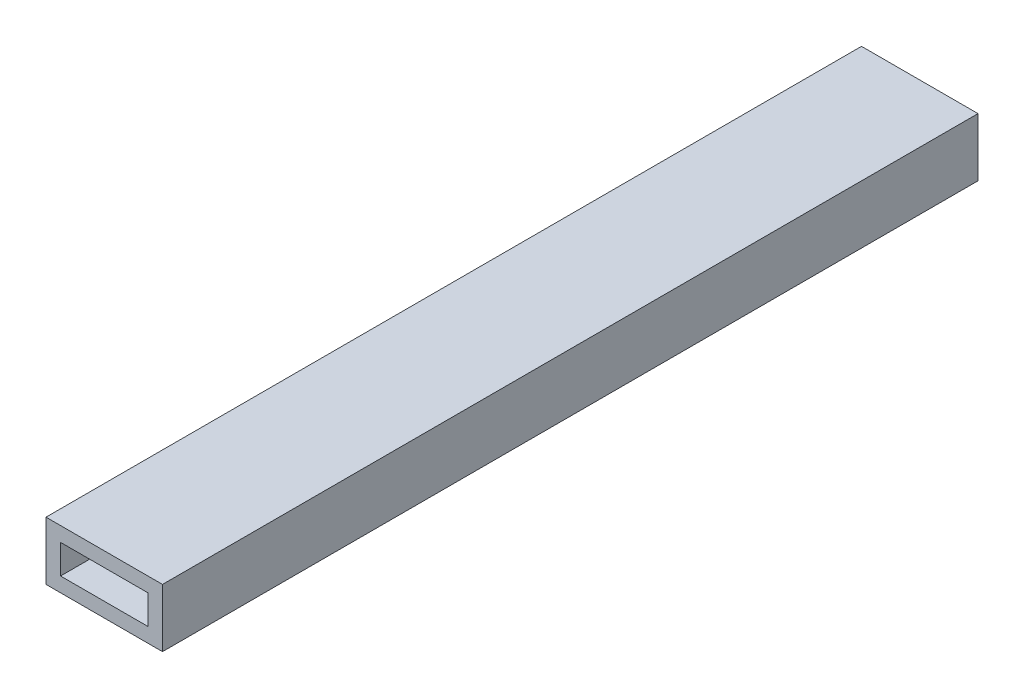
ISO-10303-21;
HEADER;
FILE_DESCRIPTION(('STEP AP214'),'2;1');
FILE_NAME('part.step','',(''),(''),'','','');
FILE_SCHEMA(('AUTOMOTIVE_DESIGN { 1 0 10303 214 1 1 1 1 }'));
ENDSEC;
DATA;
#1=APPLICATION_CONTEXT('core data for automotive mechanical design processes');
#2=APPLICATION_PROTOCOL_DEFINITION('international standard','automotive_design',2000,#1);
#3=PRODUCT_CONTEXT('',#1,'mechanical');
#4=PRODUCT('Part','Part','',(#3));
#5=PRODUCT_RELATED_PRODUCT_CATEGORY('part','',(#4));
#6=PRODUCT_DEFINITION_FORMATION('','',#4);
#7=PRODUCT_DEFINITION_CONTEXT('part definition',#1,'design');
#8=PRODUCT_DEFINITION('design','',#6,#7);
#9=PRODUCT_DEFINITION_SHAPE('','',#8);
#10=(LENGTH_UNIT() NAMED_UNIT(*) SI_UNIT(.MILLI.,.METRE.));
#11=(NAMED_UNIT(*) PLANE_ANGLE_UNIT() SI_UNIT($,.RADIAN.));
#12=(NAMED_UNIT(*) SI_UNIT($,.STERADIAN.) SOLID_ANGLE_UNIT());
#13=UNCERTAINTY_MEASURE_WITH_UNIT(LENGTH_MEASURE(1.E-05),#10,'distance_accuracy_value','');
#14=(GEOMETRIC_REPRESENTATION_CONTEXT(3) GLOBAL_UNCERTAINTY_ASSIGNED_CONTEXT((#13)) GLOBAL_UNIT_ASSIGNED_CONTEXT((#10,
#11,#12)) REPRESENTATION_CONTEXT('',''));
#15=CARTESIAN_POINT('',(0.,0.,0.));
#16=DIRECTION('',(0.,0.,1.));
#17=DIRECTION('',(1.,0.,0.));
#18=AXIS2_PLACEMENT_3D('',#15,#16,#17);
#19=CARTESIAN_POINT('',(0.,0.,177.8));
#20=DIRECTION('',(0.,0.,-1.));
#21=DIRECTION('',(-1.,0.,0.));
#22=AXIS2_PLACEMENT_3D('',#19,#20,#21);
#23=PLANE('',#22);
#24=DIRECTION('',(0.,-1.,0.));
#25=VECTOR('',#24,1.);
#26=CARTESIAN_POINT('',(0.,0.,177.8));
#27=LINE('',#26,#25);
#28=CARTESIAN_POINT('',(0.,12.7,177.8));
#29=VERTEX_POINT('',#28);
#30=CARTESIAN_POINT('',(0.,0.,177.8));
#31=VERTEX_POINT('',#30);
#32=EDGE_CURVE('E156',#29,#31,#27,.T.);
#33=ORIENTED_EDGE('',*,*,#32,.T.);
#34=DIRECTION('',(1.,0.,0.));
#35=VECTOR('',#34,1.);
#36=CARTESIAN_POINT('',(0.,0.,177.8));
#37=LINE('',#36,#35);
#38=CARTESIAN_POINT('',(25.4,0.,177.8));
#39=VERTEX_POINT('',#38);
#40=EDGE_CURVE('E159',#31,#39,#37,.T.);
#41=ORIENTED_EDGE('',*,*,#40,.T.);
#42=DIRECTION('',(0.,1.,0.));
#43=VECTOR('',#42,1.);
#44=CARTESIAN_POINT('',(25.4,0.,177.8));
#45=LINE('',#44,#43);
#46=CARTESIAN_POINT('',(25.4,12.7,177.8));
#47=VERTEX_POINT('',#46);
#48=EDGE_CURVE('E162',#39,#47,#45,.T.);
#49=ORIENTED_EDGE('',*,*,#48,.T.);
#50=DIRECTION('',(-1.,0.,0.));
#51=VECTOR('',#50,1.);
#52=CARTESIAN_POINT('',(0.,12.7,177.8));
#53=LINE('',#52,#51);
#54=EDGE_CURVE('E164',#47,#29,#53,.T.);
#55=ORIENTED_EDGE('',*,*,#54,.T.);
#56=EDGE_LOOP('',(#33,#41,#49,#55));
#57=FACE_BOUND('',#56,.T.);
#58=DIRECTION('',(0.,-1.,0.));
#59=VECTOR('',#58,1.);
#60=CARTESIAN_POINT('',(3.175,3.175,177.8));
#61=LINE('',#60,#59);
#62=CARTESIAN_POINT('',(3.175,9.525,177.8));
#63=VERTEX_POINT('',#62);
#64=CARTESIAN_POINT('',(3.175,3.175,177.8));
#65=VERTEX_POINT('',#64);
#66=EDGE_CURVE('E112',#63,#65,#61,.T.);
#67=ORIENTED_EDGE('',*,*,#66,.F.);
#68=DIRECTION('',(-1.,0.,0.));
#69=VECTOR('',#68,1.);
#70=CARTESIAN_POINT('',(3.175,9.525,177.8));
#71=LINE('',#70,#69);
#72=CARTESIAN_POINT('',(22.225,9.525,177.8));
#73=VERTEX_POINT('',#72);
#74=EDGE_CURVE('E135',#73,#63,#71,.T.);
#75=ORIENTED_EDGE('',*,*,#74,.F.);
#76=DIRECTION('',(0.,1.,0.));
#77=VECTOR('',#76,1.);
#78=CARTESIAN_POINT('',(22.225,3.175,177.8));
#79=LINE('',#78,#77);
#80=CARTESIAN_POINT('',(22.225,3.175,177.8));
#81=VERTEX_POINT('',#80);
#82=EDGE_CURVE('E133',#81,#73,#79,.T.);
#83=ORIENTED_EDGE('',*,*,#82,.F.);
#84=DIRECTION('',(1.,0.,0.));
#85=VECTOR('',#84,1.);
#86=CARTESIAN_POINT('',(3.175,3.175,177.8));
#87=LINE('',#86,#85);
#88=EDGE_CURVE('E120',#65,#81,#87,.T.);
#89=ORIENTED_EDGE('',*,*,#88,.F.);
#90=EDGE_LOOP('',(#67,#75,#83,#89));
#91=FACE_BOUND('',#90,.T.);
#92=ADVANCED_FACE('F38',(#57,#91),#23,.F.);
#93=CARTESIAN_POINT('',(0.,0.,0.));
#94=DIRECTION('',(0.,0.,-1.));
#95=DIRECTION('',(-1.,0.,0.));
#96=AXIS2_PLACEMENT_3D('',#93,#94,#95);
#97=PLANE('',#96);
#98=DIRECTION('',(0.,-1.,0.));
#99=VECTOR('',#98,1.);
#100=CARTESIAN_POINT('',(0.,0.,0.));
#101=LINE('',#100,#99);
#102=CARTESIAN_POINT('',(0.,12.7,0.));
#103=VERTEX_POINT('',#102);
#104=CARTESIAN_POINT('',(0.,0.,0.));
#105=VERTEX_POINT('',#104);
#106=EDGE_CURVE('E129',#103,#105,#101,.T.);
#107=ORIENTED_EDGE('',*,*,#106,.F.);
#108=DIRECTION('',(-1.,0.,0.));
#109=VECTOR('',#108,1.);
#110=CARTESIAN_POINT('',(0.,12.7,0.));
#111=LINE('',#110,#109);
#112=CARTESIAN_POINT('',(25.4,12.7,0.));
#113=VERTEX_POINT('',#112);
#114=EDGE_CURVE('E160',#113,#103,#111,.T.);
#115=ORIENTED_EDGE('',*,*,#114,.F.);
#116=DIRECTION('',(0.,1.,0.));
#117=VECTOR('',#116,1.);
#118=CARTESIAN_POINT('',(25.4,0.,0.));
#119=LINE('',#118,#117);
#120=CARTESIAN_POINT('',(25.4,0.,0.));
#121=VERTEX_POINT('',#120);
#122=EDGE_CURVE('E173',#121,#113,#119,.T.);
#123=ORIENTED_EDGE('',*,*,#122,.F.);
#124=DIRECTION('',(1.,0.,0.));
#125=VECTOR('',#124,1.);
#126=CARTESIAN_POINT('',(0.,0.,0.));
#127=LINE('',#126,#125);
#128=EDGE_CURVE('E170',#105,#121,#127,.T.);
#129=ORIENTED_EDGE('',*,*,#128,.F.);
#130=EDGE_LOOP('',(#107,#115,#123,#129));
#131=FACE_BOUND('',#130,.T.);
#132=DIRECTION('',(-1.,0.,0.));
#133=VECTOR('',#132,1.);
#134=CARTESIAN_POINT('',(3.175,9.525,0.));
#135=LINE('',#134,#133);
#136=CARTESIAN_POINT('',(22.225,9.525,0.));
#137=VERTEX_POINT('',#136);
#138=CARTESIAN_POINT('',(3.175,9.525,0.));
#139=VERTEX_POINT('',#138);
#140=EDGE_CURVE('E121',#137,#139,#135,.T.);
#141=ORIENTED_EDGE('',*,*,#140,.T.);
#142=DIRECTION('',(0.,-1.,0.));
#143=VECTOR('',#142,1.);
#144=CARTESIAN_POINT('',(3.175,3.175,0.));
#145=LINE('',#144,#143);
#146=CARTESIAN_POINT('',(3.175,3.175,0.));
#147=VERTEX_POINT('',#146);
#148=EDGE_CURVE('E65',#139,#147,#145,.T.);
#149=ORIENTED_EDGE('',*,*,#148,.T.);
#150=DIRECTION('',(1.,0.,0.));
#151=VECTOR('',#150,1.);
#152=CARTESIAN_POINT('',(3.175,3.175,0.));
#153=LINE('',#152,#151);
#154=CARTESIAN_POINT('',(22.225,3.175,0.));
#155=VERTEX_POINT('',#154);
#156=EDGE_CURVE('E127',#147,#155,#153,.T.);
#157=ORIENTED_EDGE('',*,*,#156,.T.);
#158=DIRECTION('',(0.,1.,0.));
#159=VECTOR('',#158,1.);
#160=CARTESIAN_POINT('',(22.225,3.175,0.));
#161=LINE('',#160,#159);
#162=EDGE_CURVE('E143',#155,#137,#161,.T.);
#163=ORIENTED_EDGE('',*,*,#162,.T.);
#164=EDGE_LOOP('',(#141,#149,#157,#163));
#165=FACE_BOUND('',#164,.T.);
#166=ADVANCED_FACE('F196',(#131,#165),#97,.T.);
#167=CARTESIAN_POINT('',(0.,0.,177.8));
#168=DIRECTION('',(1.,0.,0.));
#169=DIRECTION('',(0.,0.,-1.));
#170=AXIS2_PLACEMENT_3D('',#167,#168,#169);
#171=PLANE('',#170);
#172=ORIENTED_EDGE('',*,*,#106,.T.);
#173=DIRECTION('',(0.,0.,-1.));
#174=VECTOR('',#173,1.);
#175=CARTESIAN_POINT('',(0.,0.,177.8));
#176=LINE('',#175,#174);
#177=EDGE_CURVE('E11',#31,#105,#176,.T.);
#178=ORIENTED_EDGE('',*,*,#177,.F.);
#179=ORIENTED_EDGE('',*,*,#32,.F.);
#180=DIRECTION('',(0.,0.,-1.));
#181=VECTOR('',#180,1.);
#182=CARTESIAN_POINT('',(0.,12.7,177.8));
#183=LINE('',#182,#181);
#184=EDGE_CURVE('E166',#29,#103,#183,.T.);
#185=ORIENTED_EDGE('',*,*,#184,.T.);
#186=EDGE_LOOP('',(#172,#178,#179,#185));
#187=FACE_BOUND('',#186,.T.);
#188=ADVANCED_FACE('F40',(#187),#171,.F.);
#189=CARTESIAN_POINT('',(0.,0.,177.8));
#190=DIRECTION('',(0.,1.,0.));
#191=DIRECTION('',(0.,0.,1.));
#192=AXIS2_PLACEMENT_3D('',#189,#190,#191);
#193=PLANE('',#192);
#194=ORIENTED_EDGE('',*,*,#128,.T.);
#195=DIRECTION('',(0.,0.,-1.));
#196=VECTOR('',#195,1.);
#197=CARTESIAN_POINT('',(25.4,0.,177.8));
#198=LINE('',#197,#196);
#199=EDGE_CURVE('E47',#39,#121,#198,.T.);
#200=ORIENTED_EDGE('',*,*,#199,.F.);
#201=ORIENTED_EDGE('',*,*,#40,.F.);
#202=ORIENTED_EDGE('',*,*,#177,.T.);
#203=EDGE_LOOP('',(#194,#200,#201,#202));
#204=FACE_BOUND('',#203,.T.);
#205=ADVANCED_FACE('F206',(#204),#193,.F.);
#206=CARTESIAN_POINT('',(25.4,0.,177.8));
#207=DIRECTION('',(-1.,0.,0.));
#208=DIRECTION('',(0.,0.,1.));
#209=AXIS2_PLACEMENT_3D('',#206,#207,#208);
#210=PLANE('',#209);
#211=ORIENTED_EDGE('',*,*,#122,.T.);
#212=DIRECTION('',(0.,0.,-1.));
#213=VECTOR('',#212,1.);
#214=CARTESIAN_POINT('',(25.4,12.7,177.8));
#215=LINE('',#214,#213);
#216=EDGE_CURVE('E181',#47,#113,#215,.T.);
#217=ORIENTED_EDGE('',*,*,#216,.F.);
#218=ORIENTED_EDGE('',*,*,#48,.F.);
#219=ORIENTED_EDGE('',*,*,#199,.T.);
#220=EDGE_LOOP('',(#211,#217,#218,#219));
#221=FACE_BOUND('',#220,.T.);
#222=ADVANCED_FACE('F190',(#221),#210,.F.);
#223=CARTESIAN_POINT('',(0.,12.7,177.8));
#224=DIRECTION('',(0.,-1.,0.));
#225=DIRECTION('',(0.,0.,-1.));
#226=AXIS2_PLACEMENT_3D('',#223,#224,#225);
#227=PLANE('',#226);
#228=ORIENTED_EDGE('',*,*,#114,.T.);
#229=ORIENTED_EDGE('',*,*,#184,.F.);
#230=ORIENTED_EDGE('',*,*,#54,.F.);
#231=ORIENTED_EDGE('',*,*,#216,.T.);
#232=EDGE_LOOP('',(#228,#229,#230,#231));
#233=FACE_BOUND('',#232,.T.);
#234=ADVANCED_FACE('F200',(#233),#227,.F.);
#235=CARTESIAN_POINT('',(3.175,3.175,177.8));
#236=DIRECTION('',(1.,0.,0.));
#237=DIRECTION('',(0.,0.,-1.));
#238=AXIS2_PLACEMENT_3D('',#235,#236,#237);
#239=PLANE('',#238);
#240=ORIENTED_EDGE('',*,*,#148,.F.);
#241=DIRECTION('',(0.,0.,-1.));
#242=VECTOR('',#241,1.);
#243=CARTESIAN_POINT('',(3.175,9.525,177.8));
#244=LINE('',#243,#242);
#245=EDGE_CURVE('E116',#63,#139,#244,.T.);
#246=ORIENTED_EDGE('',*,*,#245,.F.);
#247=ORIENTED_EDGE('',*,*,#66,.T.);
#248=DIRECTION('',(0.,0.,-1.));
#249=VECTOR('',#248,1.);
#250=CARTESIAN_POINT('',(3.175,3.175,177.8));
#251=LINE('',#250,#249);
#252=EDGE_CURVE('E115',#65,#147,#251,.T.);
#253=ORIENTED_EDGE('',*,*,#252,.T.);
#254=EDGE_LOOP('',(#240,#246,#247,#253));
#255=FACE_BOUND('',#254,.T.);
#256=ADVANCED_FACE('F114',(#255),#239,.T.);
#257=CARTESIAN_POINT('',(3.175,3.175,177.8));
#258=DIRECTION('',(0.,1.,0.));
#259=DIRECTION('',(0.,0.,1.));
#260=AXIS2_PLACEMENT_3D('',#257,#258,#259);
#261=PLANE('',#260);
#262=ORIENTED_EDGE('',*,*,#156,.F.);
#263=ORIENTED_EDGE('',*,*,#252,.F.);
#264=ORIENTED_EDGE('',*,*,#88,.T.);
#265=DIRECTION('',(0.,0.,-1.));
#266=VECTOR('',#265,1.);
#267=CARTESIAN_POINT('',(22.225,3.175,177.8));
#268=LINE('',#267,#266);
#269=EDGE_CURVE('E130',#81,#155,#268,.T.);
#270=ORIENTED_EDGE('',*,*,#269,.T.);
#271=EDGE_LOOP('',(#262,#263,#264,#270));
#272=FACE_BOUND('',#271,.T.);
#273=ADVANCED_FACE('F124',(#272),#261,.T.);
#274=CARTESIAN_POINT('',(22.225,3.175,177.8));
#275=DIRECTION('',(-1.,0.,0.));
#276=DIRECTION('',(0.,0.,1.));
#277=AXIS2_PLACEMENT_3D('',#274,#275,#276);
#278=PLANE('',#277);
#279=ORIENTED_EDGE('',*,*,#162,.F.);
#280=ORIENTED_EDGE('',*,*,#269,.F.);
#281=ORIENTED_EDGE('',*,*,#82,.T.);
#282=DIRECTION('',(0.,0.,-1.));
#283=VECTOR('',#282,1.);
#284=CARTESIAN_POINT('',(22.225,9.525,177.8));
#285=LINE('',#284,#283);
#286=EDGE_CURVE('E54',#73,#137,#285,.T.);
#287=ORIENTED_EDGE('',*,*,#286,.T.);
#288=EDGE_LOOP('',(#279,#280,#281,#287));
#289=FACE_BOUND('',#288,.T.);
#290=ADVANCED_FACE('F229',(#289),#278,.T.);
#291=CARTESIAN_POINT('',(3.175,9.525,177.8));
#292=DIRECTION('',(0.,-1.,0.));
#293=DIRECTION('',(0.,0.,-1.));
#294=AXIS2_PLACEMENT_3D('',#291,#292,#293);
#295=PLANE('',#294);
#296=ORIENTED_EDGE('',*,*,#140,.F.);
#297=ORIENTED_EDGE('',*,*,#286,.F.);
#298=ORIENTED_EDGE('',*,*,#74,.T.);
#299=ORIENTED_EDGE('',*,*,#245,.T.);
#300=EDGE_LOOP('',(#296,#297,#298,#299));
#301=FACE_BOUND('',#300,.T.);
#302=ADVANCED_FACE('F233',(#301),#295,.T.);
#303=CLOSED_SHELL('',(#92,#166,#188,#205,#222,#234,#256,#273,#290,#302));
#304=MANIFOLD_SOLID_BREP('B2',#303);
#305=ADVANCED_BREP_SHAPE_REPRESENTATION('',(#18,#304),#14);
#306=SHAPE_DEFINITION_REPRESENTATION(#9,#305);
ENDSEC;
END-ISO-10303-21;
